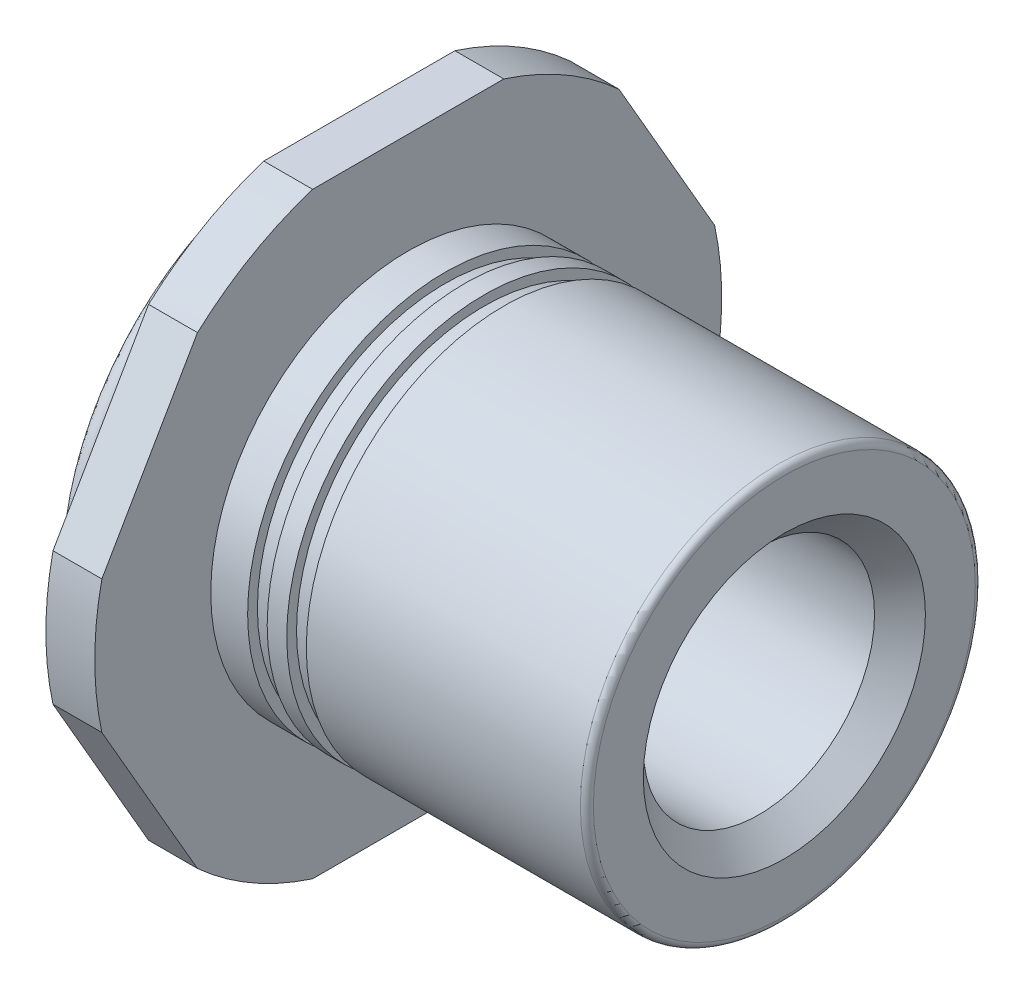
ISO-10303-21;
HEADER;
FILE_DESCRIPTION(('STEP AP214'),'2;1');
FILE_NAME('part.step','',(''),(''),'','','');
FILE_SCHEMA(('AUTOMOTIVE_DESIGN { 1 0 10303 214 1 1 1 1 }'));
ENDSEC;
DATA;
#1=APPLICATION_CONTEXT('core data for automotive mechanical design processes');
#2=APPLICATION_PROTOCOL_DEFINITION('international standard','automotive_design',2000,#1);
#3=PRODUCT_CONTEXT('',#1,'mechanical');
#4=PRODUCT('Part','Part','',(#3));
#5=PRODUCT_RELATED_PRODUCT_CATEGORY('part','',(#4));
#6=PRODUCT_DEFINITION_FORMATION('','',#4);
#7=PRODUCT_DEFINITION_CONTEXT('part definition',#1,'design');
#8=PRODUCT_DEFINITION('design','',#6,#7);
#9=PRODUCT_DEFINITION_SHAPE('','',#8);
#10=(LENGTH_UNIT() NAMED_UNIT(*) SI_UNIT(.MILLI.,.METRE.));
#11=(NAMED_UNIT(*) PLANE_ANGLE_UNIT() SI_UNIT($,.RADIAN.));
#12=(NAMED_UNIT(*) SI_UNIT($,.STERADIAN.) SOLID_ANGLE_UNIT());
#13=UNCERTAINTY_MEASURE_WITH_UNIT(LENGTH_MEASURE(1.E-05),#10,'distance_accuracy_value','');
#14=(GEOMETRIC_REPRESENTATION_CONTEXT(3) GLOBAL_UNCERTAINTY_ASSIGNED_CONTEXT((#13)) GLOBAL_UNIT_ASSIGNED_CONTEXT((#10,
#11,#12)) REPRESENTATION_CONTEXT('',''));
#15=CARTESIAN_POINT('',(0.,0.,0.));
#16=DIRECTION('',(0.,0.,1.));
#17=DIRECTION('',(1.,0.,0.));
#18=AXIS2_PLACEMENT_3D('',#15,#16,#17);
#19=CARTESIAN_POINT('',(0.,0.,0.));
#20=DIRECTION('',(-1.,0.,0.));
#21=DIRECTION('',(0.,-1.,0.));
#22=AXIS2_PLACEMENT_3D('',#19,#20,#21);
#23=CYLINDRICAL_SURFACE('',#22,3.33375);
#24=CARTESIAN_POINT('',(-0.52,0.,0.));
#25=DIRECTION('',(-1.,0.,0.));
#26=DIRECTION('',(0.,-1.,0.));
#27=AXIS2_PLACEMENT_3D('',#24,#25,#26);
#28=CIRCLE('',#27,3.33375);
#29=CARTESIAN_POINT('',(-0.52,2.46781133519625,2.24138267066936));
#30=VERTEX_POINT('',#29);
#31=CARTESIAN_POINT('',(-0.52,3.175,1.01649597269247));
#32=VERTEX_POINT('',#31);
#33=EDGE_CURVE('E159',#30,#32,#28,.T.);
#34=ORIENTED_EDGE('',*,*,#33,.F.);
#35=DIRECTION('',(-1.,0.,0.));
#36=VECTOR('',#35,1.);
#37=CARTESIAN_POINT('',(0.,2.46781133519625,2.24138267066936));
#38=LINE('',#37,#36);
#39=CARTESIAN_POINT('',(0.,2.46781133519625,2.24138267066936));
#40=VERTEX_POINT('',#39);
#41=EDGE_CURVE('E52',#40,#30,#38,.T.);
#42=ORIENTED_EDGE('',*,*,#41,.F.);
#43=CARTESIAN_POINT('',(0.,0.,0.));
#44=DIRECTION('',(-1.,0.,0.));
#45=DIRECTION('',(0.,-1.,0.));
#46=AXIS2_PLACEMENT_3D('',#43,#44,#45);
#47=CIRCLE('',#46,3.33375);
#48=CARTESIAN_POINT('',(0.,3.175,1.01649597269247));
#49=VERTEX_POINT('',#48);
#50=EDGE_CURVE('E193',#40,#49,#47,.T.);
#51=ORIENTED_EDGE('',*,*,#50,.T.);
#52=DIRECTION('',(-1.,0.,0.));
#53=VECTOR('',#52,1.);
#54=CARTESIAN_POINT('',(0.,3.175,1.01649597269247));
#55=LINE('',#54,#53);
#56=EDGE_CURVE('E105',#49,#32,#55,.T.);
#57=ORIENTED_EDGE('',*,*,#56,.T.);
#58=EDGE_LOOP('',(#34,#42,#51,#57));
#59=FACE_BOUND('',#58,.T.);
#60=ADVANCED_FACE('F35',(#59),#23,.T.);
#61=CARTESIAN_POINT('',(0.,0.70718866480375,3.25787864336183));
#62=DIRECTION('',(0.,0.500000000000001,0.866025403784438));
#63=DIRECTION('',(0.,-0.866025403784438,0.500000000000001));
#64=AXIS2_PLACEMENT_3D('',#61,#62,#63);
#65=PLANE('',#64);
#66=DIRECTION('',(0.,0.866025403784438,-0.500000000000001));
#67=VECTOR('',#66,1.);
#68=CARTESIAN_POINT('',(-0.52,0.70718866480375,3.25787864336183));
#69=LINE('',#68,#67);
#70=CARTESIAN_POINT('',(-0.52,0.70718866480375,3.25787864336183));
#71=VERTEX_POINT('',#70);
#72=EDGE_CURVE('E190',#71,#30,#69,.T.);
#73=ORIENTED_EDGE('',*,*,#72,.F.);
#74=DIRECTION('',(-1.,0.,0.));
#75=VECTOR('',#74,1.);
#76=CARTESIAN_POINT('',(0.,0.70718866480375,3.25787864336183));
#77=LINE('',#76,#75);
#78=CARTESIAN_POINT('',(0.,0.70718866480375,3.25787864336183));
#79=VERTEX_POINT('',#78);
#80=EDGE_CURVE('E93',#79,#71,#77,.T.);
#81=ORIENTED_EDGE('',*,*,#80,.F.);
#82=DIRECTION('',(0.,0.866025403784438,-0.500000000000001));
#83=VECTOR('',#82,1.);
#84=CARTESIAN_POINT('',(0.,0.70718866480375,3.25787864336183));
#85=LINE('',#84,#83);
#86=EDGE_CURVE('E149',#79,#40,#85,.T.);
#87=ORIENTED_EDGE('',*,*,#86,.T.);
#88=ORIENTED_EDGE('',*,*,#41,.T.);
#89=EDGE_LOOP('',(#73,#81,#87,#88));
#90=FACE_BOUND('',#89,.T.);
#91=ADVANCED_FACE('F242',(#90),#65,.T.);
#92=CARTESIAN_POINT('',(0.,0.,0.));
#93=DIRECTION('',(-1.,0.,0.));
#94=DIRECTION('',(0.,-1.,0.));
#95=AXIS2_PLACEMENT_3D('',#92,#93,#94);
#96=CYLINDRICAL_SURFACE('',#95,3.33375);
#97=CARTESIAN_POINT('',(-0.52,0.,0.));
#98=DIRECTION('',(-1.,0.,0.));
#99=DIRECTION('',(0.,-1.,0.));
#100=AXIS2_PLACEMENT_3D('',#97,#98,#99);
#101=CIRCLE('',#100,3.33375);
#102=CARTESIAN_POINT('',(-0.52,-0.707188664803746,3.25787864336183));
#103=VERTEX_POINT('',#102);
#104=EDGE_CURVE('E136',#103,#71,#101,.T.);
#105=ORIENTED_EDGE('',*,*,#104,.F.);
#106=DIRECTION('',(-1.,0.,0.));
#107=VECTOR('',#106,1.);
#108=CARTESIAN_POINT('',(0.,-0.707188664803746,3.25787864336183));
#109=LINE('',#108,#107);
#110=CARTESIAN_POINT('',(0.,-0.707188664803746,3.25787864336183));
#111=VERTEX_POINT('',#110);
#112=EDGE_CURVE('E131',#111,#103,#109,.T.);
#113=ORIENTED_EDGE('',*,*,#112,.F.);
#114=CARTESIAN_POINT('',(0.,0.,0.));
#115=DIRECTION('',(-1.,0.,0.));
#116=DIRECTION('',(0.,-1.,0.));
#117=AXIS2_PLACEMENT_3D('',#114,#115,#116);
#118=CIRCLE('',#117,3.33375);
#119=EDGE_CURVE('E134',#111,#79,#118,.T.);
#120=ORIENTED_EDGE('',*,*,#119,.T.);
#121=ORIENTED_EDGE('',*,*,#80,.T.);
#122=EDGE_LOOP('',(#105,#113,#120,#121));
#123=FACE_BOUND('',#122,.T.);
#124=ADVANCED_FACE('F133',(#123),#96,.T.);
#125=CARTESIAN_POINT('',(0.,-2.46781133519625,2.24138267066935));
#126=DIRECTION('',(0.,-0.5,0.866025403784439));
#127=DIRECTION('',(0.,-0.866025403784439,-0.5));
#128=AXIS2_PLACEMENT_3D('',#125,#126,#127);
#129=PLANE('',#128);
#130=DIRECTION('',(0.,0.866025403784438,0.5));
#131=VECTOR('',#130,1.);
#132=CARTESIAN_POINT('',(-0.520000000000001,-2.46781133519625,2.24138267066935));
#133=LINE('',#132,#131);
#134=CARTESIAN_POINT('',(-0.520000000000001,-2.46781133519625,2.24138267066935));
#135=VERTEX_POINT('',#134);
#136=EDGE_CURVE('E187',#135,#103,#133,.T.);
#137=ORIENTED_EDGE('',*,*,#136,.F.);
#138=DIRECTION('',(-1.,0.,0.));
#139=VECTOR('',#138,1.);
#140=CARTESIAN_POINT('',(0.,-2.46781133519625,2.24138267066935));
#141=LINE('',#140,#139);
#142=CARTESIAN_POINT('',(0.,-2.46781133519625,2.24138267066935));
#143=VERTEX_POINT('',#142);
#144=EDGE_CURVE('E141',#143,#135,#141,.T.);
#145=ORIENTED_EDGE('',*,*,#144,.F.);
#146=DIRECTION('',(0.,0.866025403784438,0.5));
#147=VECTOR('',#146,1.);
#148=CARTESIAN_POINT('',(0.,-2.46781133519625,2.24138267066935));
#149=LINE('',#148,#147);
#150=EDGE_CURVE('E147',#143,#111,#149,.T.);
#151=ORIENTED_EDGE('',*,*,#150,.T.);
#152=ORIENTED_EDGE('',*,*,#112,.T.);
#153=EDGE_LOOP('',(#137,#145,#151,#152));
#154=FACE_BOUND('',#153,.T.);
#155=ADVANCED_FACE('F151',(#154),#129,.T.);
#156=CARTESIAN_POINT('',(0.,0.,0.));
#157=DIRECTION('',(-1.,0.,0.));
#158=DIRECTION('',(0.,-1.,0.));
#159=AXIS2_PLACEMENT_3D('',#156,#157,#158);
#160=CYLINDRICAL_SURFACE('',#159,3.33375);
#161=CARTESIAN_POINT('',(-0.52,0.,0.));
#162=DIRECTION('',(-1.,0.,0.));
#163=DIRECTION('',(0.,-1.,0.));
#164=AXIS2_PLACEMENT_3D('',#161,#162,#163);
#165=CIRCLE('',#164,3.33375);
#166=CARTESIAN_POINT('',(-0.520000000000001,-3.175,1.01649597269246));
#167=VERTEX_POINT('',#166);
#168=EDGE_CURVE('E184',#167,#135,#165,.T.);
#169=ORIENTED_EDGE('',*,*,#168,.F.);
#170=DIRECTION('',(-1.,0.,0.));
#171=VECTOR('',#170,1.);
#172=CARTESIAN_POINT('',(0.,-3.175,1.01649597269246));
#173=LINE('',#172,#171);
#174=CARTESIAN_POINT('',(0.,-3.175,1.01649597269246));
#175=VERTEX_POINT('',#174);
#176=EDGE_CURVE('E198',#175,#167,#173,.T.);
#177=ORIENTED_EDGE('',*,*,#176,.F.);
#178=CARTESIAN_POINT('',(0.,0.,0.));
#179=DIRECTION('',(-1.,0.,0.));
#180=DIRECTION('',(0.,-1.,0.));
#181=AXIS2_PLACEMENT_3D('',#178,#179,#180);
#182=CIRCLE('',#181,3.33375);
#183=EDGE_CURVE('E152',#175,#143,#182,.T.);
#184=ORIENTED_EDGE('',*,*,#183,.T.);
#185=ORIENTED_EDGE('',*,*,#144,.T.);
#186=EDGE_LOOP('',(#169,#177,#184,#185));
#187=FACE_BOUND('',#186,.T.);
#188=ADVANCED_FACE('F355',(#187),#160,.T.);
#189=CARTESIAN_POINT('',(0.,-3.175,-1.01649597269246));
#190=DIRECTION('',(0.,-1.,0.));
#191=DIRECTION('',(0.,0.,-1.));
#192=AXIS2_PLACEMENT_3D('',#189,#190,#191);
#193=PLANE('',#192);
#194=DIRECTION('',(0.,0.,1.));
#195=VECTOR('',#194,1.);
#196=CARTESIAN_POINT('',(-0.520000000000001,-3.175,-1.01649597269246));
#197=LINE('',#196,#195);
#198=CARTESIAN_POINT('',(-0.520000000000001,-3.175,-1.01649597269247));
#199=VERTEX_POINT('',#198);
#200=EDGE_CURVE('E181',#199,#167,#197,.T.);
#201=ORIENTED_EDGE('',*,*,#200,.F.);
#202=DIRECTION('',(-1.,0.,0.));
#203=VECTOR('',#202,1.);
#204=CARTESIAN_POINT('',(0.,-3.175,-1.01649597269247));
#205=LINE('',#204,#203);
#206=CARTESIAN_POINT('',(0.,-3.175,-1.01649597269247));
#207=VERTEX_POINT('',#206);
#208=EDGE_CURVE('E200',#207,#199,#205,.T.);
#209=ORIENTED_EDGE('',*,*,#208,.F.);
#210=DIRECTION('',(0.,0.,1.));
#211=VECTOR('',#210,1.);
#212=CARTESIAN_POINT('',(0.,-3.175,-1.01649597269246));
#213=LINE('',#212,#211);
#214=EDGE_CURVE('E154',#207,#175,#213,.T.);
#215=ORIENTED_EDGE('',*,*,#214,.T.);
#216=ORIENTED_EDGE('',*,*,#176,.T.);
#217=EDGE_LOOP('',(#201,#209,#215,#216));
#218=FACE_BOUND('',#217,.T.);
#219=ADVANCED_FACE('F330',(#218),#193,.T.);
#220=CARTESIAN_POINT('',(0.,0.,0.));
#221=DIRECTION('',(-1.,0.,0.));
#222=DIRECTION('',(0.,-1.,0.));
#223=AXIS2_PLACEMENT_3D('',#220,#221,#222);
#224=CYLINDRICAL_SURFACE('',#223,3.33375);
#225=CARTESIAN_POINT('',(-0.52,0.,0.));
#226=DIRECTION('',(-1.,0.,0.));
#227=DIRECTION('',(0.,-1.,0.));
#228=AXIS2_PLACEMENT_3D('',#225,#226,#227);
#229=CIRCLE('',#228,3.33375);
#230=CARTESIAN_POINT('',(-0.520000000000001,-2.46781133519624,-2.24138267066937));
#231=VERTEX_POINT('',#230);
#232=EDGE_CURVE('E178',#231,#199,#229,.T.);
#233=ORIENTED_EDGE('',*,*,#232,.F.);
#234=DIRECTION('',(-1.,0.,0.));
#235=VECTOR('',#234,1.);
#236=CARTESIAN_POINT('',(0.,-2.46781133519624,-2.24138267066937));
#237=LINE('',#236,#235);
#238=CARTESIAN_POINT('',(0.,-2.46781133519624,-2.24138267066937));
#239=VERTEX_POINT('',#238);
#240=EDGE_CURVE('E202',#239,#231,#237,.T.);
#241=ORIENTED_EDGE('',*,*,#240,.F.);
#242=CARTESIAN_POINT('',(0.,0.,0.));
#243=DIRECTION('',(-1.,0.,0.));
#244=DIRECTION('',(0.,-1.,0.));
#245=AXIS2_PLACEMENT_3D('',#242,#243,#244);
#246=CIRCLE('',#245,3.33375);
#247=EDGE_CURVE('E324',#239,#207,#246,.T.);
#248=ORIENTED_EDGE('',*,*,#247,.T.);
#249=ORIENTED_EDGE('',*,*,#208,.T.);
#250=EDGE_LOOP('',(#233,#241,#248,#249));
#251=FACE_BOUND('',#250,.T.);
#252=ADVANCED_FACE('F336',(#251),#224,.T.);
#253=CARTESIAN_POINT('',(0.,-0.707188664803765,-3.25787864336182));
#254=DIRECTION('',(0.,-0.499999999999999,-0.866025403784439));
#255=DIRECTION('',(0.,0.86602540378444,-0.499999999999999));
#256=AXIS2_PLACEMENT_3D('',#253,#254,#255);
#257=PLANE('',#256);
#258=DIRECTION('',(0.,-0.866025403784439,0.499999999999999));
#259=VECTOR('',#258,1.);
#260=CARTESIAN_POINT('',(-0.52,-0.707188664803765,-3.25787864336182));
#261=LINE('',#260,#259);
#262=CARTESIAN_POINT('',(-0.52,-0.707188664803765,-3.25787864336182));
#263=VERTEX_POINT('',#262);
#264=EDGE_CURVE('E175',#263,#231,#261,.T.);
#265=ORIENTED_EDGE('',*,*,#264,.F.);
#266=DIRECTION('',(-1.,0.,0.));
#267=VECTOR('',#266,1.);
#268=CARTESIAN_POINT('',(0.,-0.707188664803765,-3.25787864336182));
#269=LINE('',#268,#267);
#270=CARTESIAN_POINT('',(0.,-0.707188664803765,-3.25787864336182));
#271=VERTEX_POINT('',#270);
#272=EDGE_CURVE('E204',#271,#263,#269,.T.);
#273=ORIENTED_EDGE('',*,*,#272,.F.);
#274=DIRECTION('',(0.,-0.866025403784439,0.499999999999999));
#275=VECTOR('',#274,1.);
#276=CARTESIAN_POINT('',(0.,-0.707188664803765,-3.25787864336182));
#277=LINE('',#276,#275);
#278=EDGE_CURVE('E321',#271,#239,#277,.T.);
#279=ORIENTED_EDGE('',*,*,#278,.T.);
#280=ORIENTED_EDGE('',*,*,#240,.T.);
#281=EDGE_LOOP('',(#265,#273,#279,#280));
#282=FACE_BOUND('',#281,.T.);
#283=ADVANCED_FACE('F339',(#282),#257,.T.);
#284=CARTESIAN_POINT('',(0.,0.,0.));
#285=DIRECTION('',(-1.,0.,0.));
#286=DIRECTION('',(0.,-1.,0.));
#287=AXIS2_PLACEMENT_3D('',#284,#285,#286);
#288=CYLINDRICAL_SURFACE('',#287,3.33375);
#289=CARTESIAN_POINT('',(-0.52,0.,0.));
#290=DIRECTION('',(-1.,0.,0.));
#291=DIRECTION('',(0.,-1.,0.));
#292=AXIS2_PLACEMENT_3D('',#289,#290,#291);
#293=CIRCLE('',#292,3.33375);
#294=CARTESIAN_POINT('',(-0.52,0.707188664803753,-3.25787864336183));
#295=VERTEX_POINT('',#294);
#296=EDGE_CURVE('E172',#295,#263,#293,.T.);
#297=ORIENTED_EDGE('',*,*,#296,.F.);
#298=DIRECTION('',(-1.,0.,0.));
#299=VECTOR('',#298,1.);
#300=CARTESIAN_POINT('',(0.,0.707188664803753,-3.25787864336183));
#301=LINE('',#300,#299);
#302=CARTESIAN_POINT('',(0.,0.707188664803753,-3.25787864336183));
#303=VERTEX_POINT('',#302);
#304=EDGE_CURVE('E206',#303,#295,#301,.T.);
#305=ORIENTED_EDGE('',*,*,#304,.F.);
#306=CARTESIAN_POINT('',(0.,0.,0.));
#307=DIRECTION('',(-1.,0.,0.));
#308=DIRECTION('',(0.,-1.,0.));
#309=AXIS2_PLACEMENT_3D('',#306,#307,#308);
#310=CIRCLE('',#309,3.33375);
#311=EDGE_CURVE('E318',#303,#271,#310,.T.);
#312=ORIENTED_EDGE('',*,*,#311,.T.);
#313=ORIENTED_EDGE('',*,*,#272,.T.);
#314=EDGE_LOOP('',(#297,#305,#312,#313));
#315=FACE_BOUND('',#314,.T.);
#316=ADVANCED_FACE('F344',(#315),#288,.T.);
#317=CARTESIAN_POINT('',(0.,2.46781133519625,-2.24138267066936));
#318=DIRECTION('',(0.,0.500000000000001,-0.866025403784438));
#319=DIRECTION('',(0.,0.866025403784438,0.500000000000001));
#320=AXIS2_PLACEMENT_3D('',#317,#318,#319);
#321=PLANE('',#320);
#322=DIRECTION('',(0.,-0.866025403784438,-0.500000000000001));
#323=VECTOR('',#322,1.);
#324=CARTESIAN_POINT('',(-0.52,2.46781133519625,-2.24138267066936));
#325=LINE('',#324,#323);
#326=CARTESIAN_POINT('',(-0.52,2.46781133519625,-2.24138267066935));
#327=VERTEX_POINT('',#326);
#328=EDGE_CURVE('E169',#327,#295,#325,.T.);
#329=ORIENTED_EDGE('',*,*,#328,.F.);
#330=DIRECTION('',(-1.,0.,0.));
#331=VECTOR('',#330,1.);
#332=CARTESIAN_POINT('',(0.,2.46781133519625,-2.24138267066935));
#333=LINE('',#332,#331);
#334=CARTESIAN_POINT('',(0.,2.46781133519625,-2.24138267066935));
#335=VERTEX_POINT('',#334);
#336=EDGE_CURVE('E208',#335,#327,#333,.T.);
#337=ORIENTED_EDGE('',*,*,#336,.F.);
#338=DIRECTION('',(0.,-0.866025403784438,-0.500000000000001));
#339=VECTOR('',#338,1.);
#340=CARTESIAN_POINT('',(0.,2.46781133519625,-2.24138267066936));
#341=LINE('',#340,#339);
#342=EDGE_CURVE('E315',#335,#303,#341,.T.);
#343=ORIENTED_EDGE('',*,*,#342,.T.);
#344=ORIENTED_EDGE('',*,*,#304,.T.);
#345=EDGE_LOOP('',(#329,#337,#343,#344));
#346=FACE_BOUND('',#345,.T.);
#347=ADVANCED_FACE('F347',(#346),#321,.T.);
#348=CARTESIAN_POINT('',(0.,0.,0.));
#349=DIRECTION('',(-1.,0.,0.));
#350=DIRECTION('',(0.,-1.,0.));
#351=AXIS2_PLACEMENT_3D('',#348,#349,#350);
#352=CYLINDRICAL_SURFACE('',#351,3.33375);
#353=CARTESIAN_POINT('',(-0.52,0.,0.));
#354=DIRECTION('',(-1.,0.,0.));
#355=DIRECTION('',(0.,-1.,0.));
#356=AXIS2_PLACEMENT_3D('',#353,#354,#355);
#357=CIRCLE('',#356,3.33375);
#358=CARTESIAN_POINT('',(-0.52,3.175,-1.01649597269247));
#359=VERTEX_POINT('',#358);
#360=EDGE_CURVE('E166',#359,#327,#357,.T.);
#361=ORIENTED_EDGE('',*,*,#360,.F.);
#362=DIRECTION('',(-1.,0.,0.));
#363=VECTOR('',#362,1.);
#364=CARTESIAN_POINT('',(0.,3.175,-1.01649597269247));
#365=LINE('',#364,#363);
#366=CARTESIAN_POINT('',(0.,3.175,-1.01649597269247));
#367=VERTEX_POINT('',#366);
#368=EDGE_CURVE('E210',#367,#359,#365,.T.);
#369=ORIENTED_EDGE('',*,*,#368,.F.);
#370=CARTESIAN_POINT('',(0.,0.,0.));
#371=DIRECTION('',(-1.,0.,0.));
#372=DIRECTION('',(0.,-1.,0.));
#373=AXIS2_PLACEMENT_3D('',#370,#371,#372);
#374=CIRCLE('',#373,3.33375);
#375=EDGE_CURVE('E312',#367,#335,#374,.T.);
#376=ORIENTED_EDGE('',*,*,#375,.T.);
#377=ORIENTED_EDGE('',*,*,#336,.T.);
#378=EDGE_LOOP('',(#361,#369,#376,#377));
#379=FACE_BOUND('',#378,.T.);
#380=ADVANCED_FACE('F351',(#379),#352,.T.);
#381=CARTESIAN_POINT('',(0.,3.175,1.01649597269247));
#382=DIRECTION('',(0.,1.,0.));
#383=DIRECTION('',(0.,0.,1.));
#384=AXIS2_PLACEMENT_3D('',#381,#382,#383);
#385=PLANE('',#384);
#386=DIRECTION('',(0.,0.,-1.));
#387=VECTOR('',#386,1.);
#388=CARTESIAN_POINT('',(-0.52,3.175,1.01649597269247));
#389=LINE('',#388,#387);
#390=EDGE_CURVE('E162',#32,#359,#389,.T.);
#391=ORIENTED_EDGE('',*,*,#390,.F.);
#392=ORIENTED_EDGE('',*,*,#56,.F.);
#393=DIRECTION('',(0.,0.,-1.));
#394=VECTOR('',#393,1.);
#395=CARTESIAN_POINT('',(0.,3.175,1.01649597269247));
#396=LINE('',#395,#394);
#397=EDGE_CURVE('E310',#49,#367,#396,.T.);
#398=ORIENTED_EDGE('',*,*,#397,.T.);
#399=ORIENTED_EDGE('',*,*,#368,.T.);
#400=EDGE_LOOP('',(#391,#392,#398,#399));
#401=FACE_BOUND('',#400,.T.);
#402=ADVANCED_FACE('F250',(#401),#385,.T.);
#403=CARTESIAN_POINT('',(0.,0.,0.));
#404=DIRECTION('',(-1.,0.,0.));
#405=DIRECTION('',(0.,-1.,0.));
#406=AXIS2_PLACEMENT_3D('',#403,#404,#405);
#407=PLANE('',#406);
#408=CARTESIAN_POINT('',(0.,0.,0.));
#409=DIRECTION('',(-1.,0.,0.));
#410=DIRECTION('',(0.,0.,1.));
#411=AXIS2_PLACEMENT_3D('',#408,#409,#410);
#412=CIRCLE('',#411,2.1);
#413=CARTESIAN_POINT('',(0.,0.,2.1));
#414=VERTEX_POINT('',#413);
#415=EDGE_CURVE('E296',#414,#414,#412,.T.);
#416=ORIENTED_EDGE('',*,*,#415,.T.);
#417=EDGE_LOOP('',(#416));
#418=FACE_BOUND('',#417,.T.);
#419=ORIENTED_EDGE('',*,*,#50,.F.);
#420=ORIENTED_EDGE('',*,*,#86,.F.);
#421=ORIENTED_EDGE('',*,*,#119,.F.);
#422=ORIENTED_EDGE('',*,*,#150,.F.);
#423=ORIENTED_EDGE('',*,*,#183,.F.);
#424=ORIENTED_EDGE('',*,*,#214,.F.);
#425=ORIENTED_EDGE('',*,*,#247,.F.);
#426=ORIENTED_EDGE('',*,*,#278,.F.);
#427=ORIENTED_EDGE('',*,*,#311,.F.);
#428=ORIENTED_EDGE('',*,*,#342,.F.);
#429=ORIENTED_EDGE('',*,*,#375,.F.);
#430=ORIENTED_EDGE('',*,*,#397,.F.);
#431=EDGE_LOOP('',(#419,#420,#421,#422,#423,#424,#425,#426,#427,#428,#429,#430));
#432=FACE_BOUND('',#431,.T.);
#433=ADVANCED_FACE('F145',(#418,#432),#407,.F.);
#434=CARTESIAN_POINT('',(-0.52,0.,0.));
#435=DIRECTION('',(-1.,0.,0.));
#436=DIRECTION('',(0.,-1.,0.));
#437=AXIS2_PLACEMENT_3D('',#434,#435,#436);
#438=PLANE('',#437);
#439=CARTESIAN_POINT('',(-0.52,0.,0.));
#440=DIRECTION('',(-1.,0.,0.));
#441=DIRECTION('',(0.,-1.,0.));
#442=AXIS2_PLACEMENT_3D('',#439,#440,#441);
#443=CIRCLE('',#442,2.49541154382014);
#444=CARTESIAN_POINT('',(-0.520000000000001,-2.49541154382014,0.));
#445=VERTEX_POINT('',#444);
#446=EDGE_CURVE('E195',#445,#445,#443,.T.);
#447=ORIENTED_EDGE('',*,*,#446,.F.);
#448=EDGE_LOOP('',(#447));
#449=FACE_BOUND('',#448,.T.);
#450=ORIENTED_EDGE('',*,*,#33,.T.);
#451=ORIENTED_EDGE('',*,*,#390,.T.);
#452=ORIENTED_EDGE('',*,*,#360,.T.);
#453=ORIENTED_EDGE('',*,*,#328,.T.);
#454=ORIENTED_EDGE('',*,*,#296,.T.);
#455=ORIENTED_EDGE('',*,*,#264,.T.);
#456=ORIENTED_EDGE('',*,*,#232,.T.);
#457=ORIENTED_EDGE('',*,*,#200,.T.);
#458=ORIENTED_EDGE('',*,*,#168,.T.);
#459=ORIENTED_EDGE('',*,*,#136,.T.);
#460=ORIENTED_EDGE('',*,*,#104,.T.);
#461=ORIENTED_EDGE('',*,*,#72,.T.);
#462=EDGE_LOOP('',(#450,#451,#452,#453,#454,#455,#456,#457,#458,#459,#460,#461));
#463=FACE_BOUND('',#462,.T.);
#464=ADVANCED_FACE('F353',(#449,#463),#438,.T.);
#465=CARTESIAN_POINT('',(-0.52,0.,0.));
#466=DIRECTION('',(-1.,0.,0.));
#467=DIRECTION('',(0.,0.,1.));
#468=AXIS2_PLACEMENT_3D('',#465,#466,#467);
#469=CYLINDRICAL_SURFACE('',#468,2.49541154382014);
#470=ORIENTED_EDGE('',*,*,#446,.T.);
#471=EDGE_LOOP('',(#470));
#472=FACE_BOUND('',#471,.T.);
#473=CARTESIAN_POINT('',(-0.693333333333333,0.,0.));
#474=DIRECTION('',(-1.,0.,0.));
#475=DIRECTION('',(0.,0.,1.));
#476=AXIS2_PLACEMENT_3D('',#473,#474,#475);
#477=CIRCLE('',#476,2.49541154382014);
#478=CARTESIAN_POINT('',(-0.693333333333333,0.,2.49541154382014));
#479=VERTEX_POINT('',#478);
#480=EDGE_CURVE('E298',#479,#479,#477,.T.);
#481=ORIENTED_EDGE('',*,*,#480,.F.);
#482=EDGE_LOOP('',(#481));
#483=FACE_BOUND('',#482,.T.);
#484=ADVANCED_FACE('F385',(#472,#483),#469,.T.);
#485=CARTESIAN_POINT('',(-1.04,0.,0.));
#486=DIRECTION('',(-1.,0.,0.));
#487=DIRECTION('',(0.,0.,1.));
#488=AXIS2_PLACEMENT_3D('',#485,#486,#487);
#489=PLANE('',#488);
#490=CARTESIAN_POINT('',(-1.04,0.,0.));
#491=DIRECTION('',(-1.,0.,0.));
#492=DIRECTION('',(0.,0.,1.));
#493=AXIS2_PLACEMENT_3D('',#490,#491,#492);
#494=CIRCLE('',#493,1.49999999999916);
#495=CARTESIAN_POINT('',(-1.04,0.,1.49999999999916));
#496=VERTEX_POINT('',#495);
#497=EDGE_CURVE('E224',#496,#496,#494,.F.);
#498=ORIENTED_EDGE('',*,*,#497,.T.);
#499=EDGE_LOOP('',(#498));
#500=FACE_BOUND('',#499,.T.);
#501=CARTESIAN_POINT('',(-1.04,0.,0.));
#502=DIRECTION('',(-1.,0.,0.));
#503=DIRECTION('',(0.,0.,1.));
#504=AXIS2_PLACEMENT_3D('',#501,#502,#503);
#505=CIRCLE('',#504,2.5910000000007);
#506=CARTESIAN_POINT('',(-1.04,0.,2.5910000000007));
#507=VERTEX_POINT('',#506);
#508=EDGE_CURVE('E163',#507,#507,#505,.T.);
#509=ORIENTED_EDGE('',*,*,#508,.T.);
#510=EDGE_LOOP('',(#509));
#511=FACE_BOUND('',#510,.T.);
#512=ADVANCED_FACE('F288',(#500,#511),#489,.T.);
#513=CARTESIAN_POINT('',(-1.04,2.5910000000007,0.));
#514=CARTESIAN_POINT('',(-1.03999999999992,2.60245587232449,0.));
#515=CARTESIAN_POINT('',(-1.03805512520087,2.61406487439666,0.));
#516=CARTESIAN_POINT('',(-1.03432147549837,2.62489524237739,0.));
#517=CARTESIAN_POINT('',(-1.03052779148617,2.63589975461842,0.));
#518=CARTESIAN_POINT('',(-1.02478184504734,2.64640104076673,0.));
#519=CARTESIAN_POINT('',(-1.01755946050474,2.65552948475058,0.));
#520=CARTESIAN_POINT('',(-1.01033707596215,2.66465792873442,0.));
#521=CARTESIAN_POINT('',(-1.00143905103274,2.67266530430962,0.));
#522=CARTESIAN_POINT('',(-0.991602235029655,2.67888851722328,0.));
#523=CARTESIAN_POINT('',(-0.981765419026574,2.68511173013695,0.));
#524=CARTESIAN_POINT('',(-0.970718500419092,2.68972242428495,0.));
#525=CARTESIAN_POINT('',(-0.959376279340152,2.69233878608021,0.));
#526=CARTESIAN_POINT('',(-0.948034058261212,2.69495514787548,0.));
#527=CARTESIAN_POINT('',(-0.936083702249388,2.69564933980671,0.));
#528=CARTESIAN_POINT('',(-0.924514825481879,2.69436387553826,0.));
#529=CARTESIAN_POINT('',(-0.912945948714661,2.69307841126984,0.));
#530=CARTESIAN_POINT('',(-0.901439467286594,2.68977783611017,0.));
#531=CARTESIAN_POINT('',(-0.890948237927558,2.68473547212325,0.));
#532=CARTESIAN_POINT('',(-0.880457008568521,2.67969310813634,0.));
#533=CARTESIAN_POINT('',(-0.870691670219444,2.67276988069769,0.));
#534=CARTESIAN_POINT('',(-0.862460894794817,2.66453910528162,0.));
#535=B_SPLINE_CURVE_WITH_KNOTS('',3,(#513,#514,#515,#516,#517,#518,#519,#520,#521,#522,#523,
#524,#525,#526,#527,#528,#529,#530,#531,#532,#533,#534),.UNSPECIFIED.,.F.,.F.,(4,3,3,3,3,3,3,4),
(0.,3.43519788234844E-05,6.92722015093064E-05,0.000104192424195128,0.00013911264688095,
0.000174032869566772,0.000208953092251687,0.000243873314936602),.UNSPECIFIED.);
#536=CARTESIAN_POINT('',(-0.52,0.,0.));
#537=DIRECTION('',(-1.,0.,0.));
#538=AXIS1_PLACEMENT('',#536,#537);
#539=SURFACE_OF_REVOLUTION('',#535,#538);
#540=CARTESIAN_POINT('',(-0.862460894794817,0.,0.));
#541=DIRECTION('',(-1.,0.,0.));
#542=DIRECTION('',(0.,0.,1.));
#543=AXIS2_PLACEMENT_3D('',#540,#541,#542);
#544=CIRCLE('',#543,2.66453910528162);
#545=CARTESIAN_POINT('',(-0.862460894794817,0.,2.66453910528162));
#546=VERTEX_POINT('',#545);
#547=EDGE_CURVE('E304',#546,#546,#544,.T.);
#548=ORIENTED_EDGE('',*,*,#547,.T.);
#549=EDGE_LOOP('',(#548));
#550=FACE_BOUND('',#549,.T.);
#551=ORIENTED_EDGE('',*,*,#508,.F.);
#552=EDGE_LOOP('',(#551));
#553=FACE_BOUND('',#552,.T.);
#554=ADVANCED_FACE('F283',(#550,#553),#539,.F.);
#555=CARTESIAN_POINT('',(-0.862460894794817,0.,0.));
#556=DIRECTION('',(-1.,0.,0.));
#557=DIRECTION('',(0.,0.,1.));
#558=AXIS2_PLACEMENT_3D('',#555,#556,#557);
#559=CONICAL_SURFACE('',#558,2.66453910528162,0.785398163397448);
#560=ORIENTED_EDGE('',*,*,#480,.T.);
#561=EDGE_LOOP('',(#560));
#562=FACE_BOUND('',#561,.T.);
#563=ORIENTED_EDGE('',*,*,#547,.F.);
#564=EDGE_LOOP('',(#563));
#565=FACE_BOUND('',#564,.T.);
#566=ADVANCED_FACE('F277',(#562,#565),#559,.T.);
#567=CARTESIAN_POINT('',(4.,0.,0.));
#568=DIRECTION('',(-1.,0.,0.));
#569=DIRECTION('',(0.,0.,1.));
#570=AXIS2_PLACEMENT_3D('',#567,#568,#569);
#571=CYLINDRICAL_SURFACE('',#570,2.1);
#572=CARTESIAN_POINT('',(3.93066666666667,0.,0.));
#573=DIRECTION('',(1.,0.,0.));
#574=DIRECTION('',(0.,0.,-1.));
#575=AXIS2_PLACEMENT_3D('',#572,#573,#574);
#576=CIRCLE('',#575,2.1);
#577=CARTESIAN_POINT('',(3.93066666666667,0.,-2.1));
#578=VERTEX_POINT('',#577);
#579=EDGE_CURVE('E44',#578,#578,#576,.F.);
#580=ORIENTED_EDGE('',*,*,#579,.T.);
#581=EDGE_LOOP('',(#580));
#582=FACE_BOUND('',#581,.T.);
#583=CARTESIAN_POINT('',(1.016,0.,0.));
#584=DIRECTION('',(-1.,0.,0.));
#585=DIRECTION('',(0.,0.,1.));
#586=AXIS2_PLACEMENT_3D('',#583,#584,#585);
#587=CIRCLE('',#586,2.1);
#588=CARTESIAN_POINT('',(1.016,0.,2.1));
#589=VERTEX_POINT('',#588);
#590=EDGE_CURVE('E595',#589,#589,#587,.T.);
#591=ORIENTED_EDGE('',*,*,#590,.F.);
#592=EDGE_LOOP('',(#591));
#593=FACE_BOUND('',#592,.T.);
#594=ADVANCED_FACE('F229',(#582,#593),#571,.T.);
#595=CARTESIAN_POINT('',(4.,2.1,0.));
#596=DIRECTION('',(1.,0.,0.));
#597=DIRECTION('',(0.,0.,-1.));
#598=AXIS2_PLACEMENT_3D('',#595,#596,#597);
#599=PLANE('',#598);
#600=CARTESIAN_POINT('',(4.,0.,0.));
#601=DIRECTION('',(1.,0.,0.));
#602=DIRECTION('',(0.,0.,-1.));
#603=AXIS2_PLACEMENT_3D('',#600,#601,#602);
#604=CIRCLE('',#603,2.03066666666667);
#605=CARTESIAN_POINT('',(4.,0.,-2.03066666666667));
#606=VERTEX_POINT('',#605);
#607=EDGE_CURVE('E11',#606,#606,#604,.T.);
#608=ORIENTED_EDGE('',*,*,#607,.T.);
#609=EDGE_LOOP('',(#608));
#610=FACE_BOUND('',#609,.T.);
#611=CARTESIAN_POINT('',(4.,0.,0.));
#612=DIRECTION('',(1.,0.,0.));
#613=DIRECTION('',(0.,0.,-1.));
#614=AXIS2_PLACEMENT_3D('',#611,#612,#613);
#615=CIRCLE('',#614,1.49999999999916);
#616=CARTESIAN_POINT('',(4.,0.,-1.49999999999916));
#617=VERTEX_POINT('',#616);
#618=EDGE_CURVE('E215',#617,#617,#615,.F.);
#619=ORIENTED_EDGE('',*,*,#618,.T.);
#620=EDGE_LOOP('',(#619));
#621=FACE_BOUND('',#620,.T.);
#622=ADVANCED_FACE('F265',(#610,#621),#599,.T.);
#623=CARTESIAN_POINT('',(4.,0.,0.));
#624=DIRECTION('',(-1.,0.,0.));
#625=DIRECTION('',(0.,0.,1.));
#626=AXIS2_PLACEMENT_3D('',#623,#624,#625);
#627=CYLINDRICAL_SURFACE('',#626,2.1);
#628=CARTESIAN_POINT('',(0.392,0.,0.));
#629=DIRECTION('',(-1.,0.,0.));
#630=DIRECTION('',(0.,0.,1.));
#631=AXIS2_PLACEMENT_3D('',#628,#629,#630);
#632=CIRCLE('',#631,2.1);
#633=CARTESIAN_POINT('',(0.392,0.,2.1));
#634=VERTEX_POINT('',#633);
#635=EDGE_CURVE('E616',#634,#634,#632,.T.);
#636=ORIENTED_EDGE('',*,*,#635,.T.);
#637=EDGE_LOOP('',(#636));
#638=FACE_BOUND('',#637,.T.);
#639=ORIENTED_EDGE('',*,*,#415,.F.);
#640=EDGE_LOOP('',(#639));
#641=FACE_BOUND('',#640,.T.);
#642=ADVANCED_FACE('F267',(#638,#641),#627,.T.);
#643=CARTESIAN_POINT('',(0.392,2.1,0.));
#644=DIRECTION('',(1.,0.,0.));
#645=DIRECTION('',(0.,0.,-1.));
#646=AXIS2_PLACEMENT_3D('',#643,#644,#645);
#647=PLANE('',#646);
#648=CARTESIAN_POINT('',(0.392,0.,0.));
#649=DIRECTION('',(-1.,0.,0.));
#650=DIRECTION('',(0.,0.,1.));
#651=AXIS2_PLACEMENT_3D('',#648,#649,#650);
#652=CIRCLE('',#651,1.996);
#653=CARTESIAN_POINT('',(0.392,0.,1.996));
#654=VERTEX_POINT('',#653);
#655=EDGE_CURVE('E614',#654,#654,#652,.T.);
#656=ORIENTED_EDGE('',*,*,#655,.T.);
#657=EDGE_LOOP('',(#656));
#658=FACE_BOUND('',#657,.T.);
#659=ORIENTED_EDGE('',*,*,#635,.F.);
#660=EDGE_LOOP('',(#659));
#661=FACE_BOUND('',#660,.T.);
#662=ADVANCED_FACE('F274',(#658,#661),#647,.T.);
#663=CARTESIAN_POINT('',(4.,0.,0.));
#664=DIRECTION('',(-1.,0.,0.));
#665=DIRECTION('',(0.,0.,1.));
#666=AXIS2_PLACEMENT_3D('',#663,#664,#665);
#667=CYLINDRICAL_SURFACE('',#666,1.996);
#668=CARTESIAN_POINT('',(0.6,0.,0.));
#669=DIRECTION('',(-1.,0.,0.));
#670=DIRECTION('',(0.,0.,1.));
#671=AXIS2_PLACEMENT_3D('',#668,#669,#670);
#672=CIRCLE('',#671,1.996);
#673=CARTESIAN_POINT('',(0.6,0.,1.996));
#674=VERTEX_POINT('',#673);
#675=EDGE_CURVE('E611',#674,#674,#672,.T.);
#676=ORIENTED_EDGE('',*,*,#675,.T.);
#677=EDGE_LOOP('',(#676));
#678=FACE_BOUND('',#677,.T.);
#679=ORIENTED_EDGE('',*,*,#655,.F.);
#680=EDGE_LOOP('',(#679));
#681=FACE_BOUND('',#680,.T.);
#682=ADVANCED_FACE('F489',(#678,#681),#667,.T.);
#683=CARTESIAN_POINT('',(0.6,1.996,0.));
#684=DIRECTION('',(-1.,0.,0.));
#685=DIRECTION('',(0.,0.,1.));
#686=AXIS2_PLACEMENT_3D('',#683,#684,#685);
#687=PLANE('',#686);
#688=CARTESIAN_POINT('',(0.6,0.,0.));
#689=DIRECTION('',(-1.,0.,0.));
#690=DIRECTION('',(0.,0.,1.));
#691=AXIS2_PLACEMENT_3D('',#688,#689,#690);
#692=CIRCLE('',#691,2.1);
#693=CARTESIAN_POINT('',(0.6,0.,2.1));
#694=VERTEX_POINT('',#693);
#695=EDGE_CURVE('E608',#694,#694,#692,.T.);
#696=ORIENTED_EDGE('',*,*,#695,.T.);
#697=EDGE_LOOP('',(#696));
#698=FACE_BOUND('',#697,.T.);
#699=ORIENTED_EDGE('',*,*,#675,.F.);
#700=EDGE_LOOP('',(#699));
#701=FACE_BOUND('',#700,.T.);
#702=ADVANCED_FACE('F498',(#698,#701),#687,.T.);
#703=CARTESIAN_POINT('',(4.,0.,0.));
#704=DIRECTION('',(-1.,0.,0.));
#705=DIRECTION('',(0.,0.,1.));
#706=AXIS2_PLACEMENT_3D('',#703,#704,#705);
#707=CYLINDRICAL_SURFACE('',#706,2.1);
#708=CARTESIAN_POINT('',(0.808,0.,0.));
#709=DIRECTION('',(-1.,0.,0.));
#710=DIRECTION('',(0.,0.,1.));
#711=AXIS2_PLACEMENT_3D('',#708,#709,#710);
#712=CIRCLE('',#711,2.1);
#713=CARTESIAN_POINT('',(0.808,0.,2.1));
#714=VERTEX_POINT('',#713);
#715=EDGE_CURVE('E602',#714,#714,#712,.T.);
#716=ORIENTED_EDGE('',*,*,#715,.T.);
#717=EDGE_LOOP('',(#716));
#718=FACE_BOUND('',#717,.T.);
#719=ORIENTED_EDGE('',*,*,#695,.F.);
#720=EDGE_LOOP('',(#719));
#721=FACE_BOUND('',#720,.T.);
#722=ADVANCED_FACE('F508',(#718,#721),#707,.T.);
#723=CARTESIAN_POINT('',(0.808,2.1,0.));
#724=DIRECTION('',(1.,0.,0.));
#725=DIRECTION('',(0.,0.,-1.));
#726=AXIS2_PLACEMENT_3D('',#723,#724,#725);
#727=PLANE('',#726);
#728=CARTESIAN_POINT('',(0.808,0.,0.));
#729=DIRECTION('',(-1.,0.,0.));
#730=DIRECTION('',(0.,0.,1.));
#731=AXIS2_PLACEMENT_3D('',#728,#729,#730);
#732=CIRCLE('',#731,1.996);
#733=CARTESIAN_POINT('',(0.808,0.,1.996));
#734=VERTEX_POINT('',#733);
#735=EDGE_CURVE('E599',#734,#734,#732,.T.);
#736=ORIENTED_EDGE('',*,*,#735,.T.);
#737=EDGE_LOOP('',(#736));
#738=FACE_BOUND('',#737,.T.);
#739=ORIENTED_EDGE('',*,*,#715,.F.);
#740=EDGE_LOOP('',(#739));
#741=FACE_BOUND('',#740,.T.);
#742=ADVANCED_FACE('F518',(#738,#741),#727,.T.);
#743=CARTESIAN_POINT('',(4.,0.,0.));
#744=DIRECTION('',(-1.,0.,0.));
#745=DIRECTION('',(0.,0.,1.));
#746=AXIS2_PLACEMENT_3D('',#743,#744,#745);
#747=CYLINDRICAL_SURFACE('',#746,1.996);
#748=CARTESIAN_POINT('',(1.016,0.,0.));
#749=DIRECTION('',(-1.,0.,0.));
#750=DIRECTION('',(0.,0.,1.));
#751=AXIS2_PLACEMENT_3D('',#748,#749,#750);
#752=CIRCLE('',#751,1.996);
#753=CARTESIAN_POINT('',(1.016,0.,1.996));
#754=VERTEX_POINT('',#753);
#755=EDGE_CURVE('E598',#754,#754,#752,.T.);
#756=ORIENTED_EDGE('',*,*,#755,.T.);
#757=EDGE_LOOP('',(#756));
#758=FACE_BOUND('',#757,.T.);
#759=ORIENTED_EDGE('',*,*,#735,.F.);
#760=EDGE_LOOP('',(#759));
#761=FACE_BOUND('',#760,.T.);
#762=ADVANCED_FACE('F528',(#758,#761),#747,.T.);
#763=CARTESIAN_POINT('',(1.016,1.996,0.));
#764=DIRECTION('',(-1.,0.,0.));
#765=DIRECTION('',(0.,0.,1.));
#766=AXIS2_PLACEMENT_3D('',#763,#764,#765);
#767=PLANE('',#766);
#768=ORIENTED_EDGE('',*,*,#590,.T.);
#769=EDGE_LOOP('',(#768));
#770=FACE_BOUND('',#769,.T.);
#771=ORIENTED_EDGE('',*,*,#755,.F.);
#772=EDGE_LOOP('',(#771));
#773=FACE_BOUND('',#772,.T.);
#774=ADVANCED_FACE('F258',(#770,#773),#767,.T.);
#775=CARTESIAN_POINT('',(-1.04,0.,0.));
#776=DIRECTION('',(-1.,0.,0.));
#777=DIRECTION('',(0.,0.,1.));
#778=AXIS2_PLACEMENT_3D('',#775,#776,#777);
#779=CYLINDRICAL_SURFACE('',#778,1.22949999999999);
#780=CARTESIAN_POINT('',(3.72950000000083,0.,0.));
#781=DIRECTION('',(1.,0.,0.));
#782=DIRECTION('',(0.,0.,-1.));
#783=AXIS2_PLACEMENT_3D('',#780,#781,#782);
#784=CIRCLE('',#783,1.22949999999999);
#785=CARTESIAN_POINT('',(3.72950000000083,0.,-1.22949999999999));
#786=VERTEX_POINT('',#785);
#787=EDGE_CURVE('E221',#786,#786,#784,.T.);
#788=ORIENTED_EDGE('',*,*,#787,.T.);
#789=EDGE_LOOP('',(#788));
#790=FACE_BOUND('',#789,.T.);
#791=CARTESIAN_POINT('',(-0.769500000000826,0.,0.));
#792=DIRECTION('',(-1.,0.,0.));
#793=DIRECTION('',(0.,0.,1.));
#794=AXIS2_PLACEMENT_3D('',#791,#792,#793);
#795=CIRCLE('',#794,1.22949999999999);
#796=CARTESIAN_POINT('',(-0.769500000000826,0.,1.22949999999999));
#797=VERTEX_POINT('',#796);
#798=EDGE_CURVE('E218',#797,#797,#795,.T.);
#799=ORIENTED_EDGE('',*,*,#798,.T.);
#800=EDGE_LOOP('',(#799));
#801=FACE_BOUND('',#800,.T.);
#802=ADVANCED_FACE('F253',(#790,#801),#779,.F.);
#803=CARTESIAN_POINT('',(4.,0.,0.));
#804=DIRECTION('',(1.,0.,0.));
#805=DIRECTION('',(0.,0.,-1.));
#806=AXIS2_PLACEMENT_3D('',#803,#804,#805);
#807=CONICAL_SURFACE('',#806,1.49999999999916,0.785398163397445);
#808=ORIENTED_EDGE('',*,*,#787,.F.);
#809=EDGE_LOOP('',(#808));
#810=FACE_BOUND('',#809,.T.);
#811=ORIENTED_EDGE('',*,*,#618,.F.);
#812=EDGE_LOOP('',(#811));
#813=FACE_BOUND('',#812,.T.);
#814=ADVANCED_FACE('F238',(#810,#813),#807,.F.);
#815=CARTESIAN_POINT('',(-0.769500000000826,0.,0.));
#816=DIRECTION('',(-1.,0.,0.));
#817=DIRECTION('',(0.,0.,1.));
#818=AXIS2_PLACEMENT_3D('',#815,#816,#817);
#819=CONICAL_SURFACE('',#818,1.22949999999999,0.78539816339745);
#820=ORIENTED_EDGE('',*,*,#497,.F.);
#821=EDGE_LOOP('',(#820));
#822=FACE_BOUND('',#821,.T.);
#823=ORIENTED_EDGE('',*,*,#798,.F.);
#824=EDGE_LOOP('',(#823));
#825=FACE_BOUND('',#824,.T.);
#826=ADVANCED_FACE('F233',(#822,#825),#819,.F.);
#827=CARTESIAN_POINT('',(3.93066666666667,0.,0.));
#828=DIRECTION('',(1.,0.,0.));
#829=DIRECTION('',(0.,0.,-1.));
#830=AXIS2_PLACEMENT_3D('',#827,#828,#829);
#831=TOROIDAL_SURFACE('',#830,2.03066666666667,0.0693333333333338);
#832=ORIENTED_EDGE('',*,*,#607,.F.);
#833=EDGE_LOOP('',(#832));
#834=FACE_BOUND('',#833,.T.);
#835=ORIENTED_EDGE('',*,*,#579,.F.);
#836=EDGE_LOOP('',(#835));
#837=FACE_BOUND('',#836,.T.);
#838=ADVANCED_FACE('F37',(#834,#837),#831,.T.);
#839=CLOSED_SHELL('',(#60,#91,#124,#155,#188,#219,#252,#283,#316,#347,#380,#402,#433,#464,#484,
#512,#554,#566,#594,#622,#642,#662,#682,#702,#722,#742,#762,#774,#802,#814,#826,#838));
#840=MANIFOLD_SOLID_BREP('B2',#839);
#841=ADVANCED_BREP_SHAPE_REPRESENTATION('',(#18,#840),#14);
#842=SHAPE_DEFINITION_REPRESENTATION(#9,#841);
ENDSEC;
END-ISO-10303-21;
